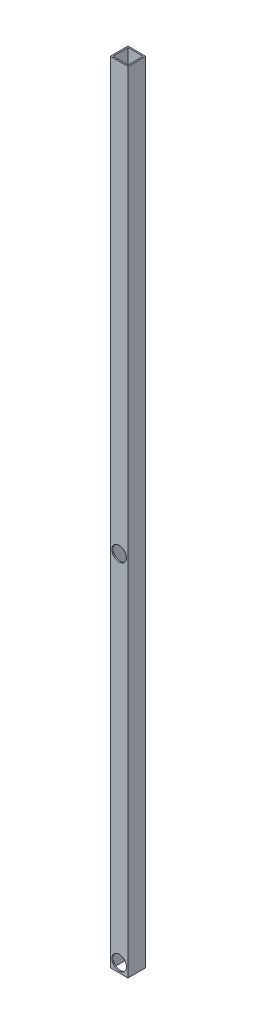
ISO-10303-21;
HEADER;
FILE_DESCRIPTION(('STEP AP214'),'2;1');
FILE_NAME('part.step','',(''),(''),'','','');
FILE_SCHEMA(('AUTOMOTIVE_DESIGN { 1 0 10303 214 1 1 1 1 }'));
ENDSEC;
DATA;
#1=APPLICATION_CONTEXT('core data for automotive mechanical design processes');
#2=APPLICATION_PROTOCOL_DEFINITION('international standard','automotive_design',2000,#1);
#3=PRODUCT_CONTEXT('',#1,'mechanical');
#4=PRODUCT('Part','Part','',(#3));
#5=PRODUCT_RELATED_PRODUCT_CATEGORY('part','',(#4));
#6=PRODUCT_DEFINITION_FORMATION('','',#4);
#7=PRODUCT_DEFINITION_CONTEXT('part definition',#1,'design');
#8=PRODUCT_DEFINITION('design','',#6,#7);
#9=PRODUCT_DEFINITION_SHAPE('','',#8);
#10=(LENGTH_UNIT() NAMED_UNIT(*) SI_UNIT(.MILLI.,.METRE.));
#11=(NAMED_UNIT(*) PLANE_ANGLE_UNIT() SI_UNIT($,.RADIAN.));
#12=(NAMED_UNIT(*) SI_UNIT($,.STERADIAN.) SOLID_ANGLE_UNIT());
#13=UNCERTAINTY_MEASURE_WITH_UNIT(LENGTH_MEASURE(1.E-05),#10,'distance_accuracy_value','');
#14=(GEOMETRIC_REPRESENTATION_CONTEXT(3) GLOBAL_UNCERTAINTY_ASSIGNED_CONTEXT((#13)) GLOBAL_UNIT_ASSIGNED_CONTEXT((#10,
#11,#12)) REPRESENTATION_CONTEXT('',''));
#15=CARTESIAN_POINT('',(0.,0.,0.));
#16=DIRECTION('',(0.,0.,1.));
#17=DIRECTION('',(1.,0.,0.));
#18=AXIS2_PLACEMENT_3D('',#15,#16,#17);
#19=CARTESIAN_POINT('',(0.,1981.2,0.));
#20=DIRECTION('',(0.,-1.,0.));
#21=DIRECTION('',(0.,0.,-1.));
#22=AXIS2_PLACEMENT_3D('',#19,#20,#21);
#23=PLANE('',#22);
#24=DIRECTION('',(0.,0.,1.));
#25=VECTOR('',#24,1.);
#26=CARTESIAN_POINT('',(0.,1981.2,0.));
#27=LINE('',#26,#25);
#28=CARTESIAN_POINT('',(0.,1981.2,-44.45));
#29=VERTEX_POINT('',#28);
#30=CARTESIAN_POINT('',(0.,1981.2,0.));
#31=VERTEX_POINT('',#30);
#32=EDGE_CURVE('E136',#29,#31,#27,.T.);
#33=ORIENTED_EDGE('',*,*,#32,.T.);
#34=DIRECTION('',(1.,0.,0.));
#35=VECTOR('',#34,1.);
#36=CARTESIAN_POINT('',(0.,1981.2,0.));
#37=LINE('',#36,#35);
#38=CARTESIAN_POINT('',(44.45,1981.2,0.));
#39=VERTEX_POINT('',#38);
#40=EDGE_CURVE('E139',#31,#39,#37,.T.);
#41=ORIENTED_EDGE('',*,*,#40,.T.);
#42=DIRECTION('',(0.,0.,-1.));
#43=VECTOR('',#42,1.);
#44=CARTESIAN_POINT('',(44.45,1981.2,0.));
#45=LINE('',#44,#43);
#46=CARTESIAN_POINT('',(44.45,1981.2,-44.45));
#47=VERTEX_POINT('',#46);
#48=EDGE_CURVE('E142',#39,#47,#45,.T.);
#49=ORIENTED_EDGE('',*,*,#48,.T.);
#50=DIRECTION('',(-1.,0.,0.));
#51=VECTOR('',#50,1.);
#52=CARTESIAN_POINT('',(0.,1981.2,-44.45));
#53=LINE('',#52,#51);
#54=EDGE_CURVE('E144',#47,#29,#53,.T.);
#55=ORIENTED_EDGE('',*,*,#54,.T.);
#56=EDGE_LOOP('',(#33,#41,#49,#55));
#57=FACE_BOUND('',#56,.T.);
#58=DIRECTION('',(1.,0.,0.));
#59=VECTOR('',#58,1.);
#60=CARTESIAN_POINT('',(3.175,1981.2,-3.175));
#61=LINE('',#60,#59);
#62=CARTESIAN_POINT('',(3.175,1981.2,-3.175));
#63=VERTEX_POINT('',#62);
#64=CARTESIAN_POINT('',(41.275,1981.2,-3.175));
#65=VERTEX_POINT('',#64);
#66=EDGE_CURVE('E98',#63,#65,#61,.T.);
#67=ORIENTED_EDGE('',*,*,#66,.F.);
#68=DIRECTION('',(0.,0.,1.));
#69=VECTOR('',#68,1.);
#70=CARTESIAN_POINT('',(3.175,1981.2,-3.175));
#71=LINE('',#70,#69);
#72=CARTESIAN_POINT('',(3.175,1981.2,-41.275));
#73=VERTEX_POINT('',#72);
#74=EDGE_CURVE('E120',#73,#63,#71,.T.);
#75=ORIENTED_EDGE('',*,*,#74,.F.);
#76=DIRECTION('',(-1.,0.,0.));
#77=VECTOR('',#76,1.);
#78=CARTESIAN_POINT('',(3.175,1981.2,-41.275));
#79=LINE('',#78,#77);
#80=CARTESIAN_POINT('',(41.275,1981.2,-41.275));
#81=VERTEX_POINT('',#80);
#82=EDGE_CURVE('E118',#81,#73,#79,.T.);
#83=ORIENTED_EDGE('',*,*,#82,.F.);
#84=DIRECTION('',(0.,0.,-1.));
#85=VECTOR('',#84,1.);
#86=CARTESIAN_POINT('',(41.275,1981.2,-3.175));
#87=LINE('',#86,#85);
#88=EDGE_CURVE('E106',#65,#81,#87,.T.);
#89=ORIENTED_EDGE('',*,*,#88,.F.);
#90=EDGE_LOOP('',(#67,#75,#83,#89));
#91=FACE_BOUND('',#90,.T.);
#92=ADVANCED_FACE('F33',(#57,#91),#23,.F.);
#93=CARTESIAN_POINT('',(0.,0.,0.));
#94=DIRECTION('',(0.,-1.,0.));
#95=DIRECTION('',(0.,0.,-1.));
#96=AXIS2_PLACEMENT_3D('',#93,#94,#95);
#97=PLANE('',#96);
#98=DIRECTION('',(0.,0.,1.));
#99=VECTOR('',#98,1.);
#100=CARTESIAN_POINT('',(0.,0.,0.));
#101=LINE('',#100,#99);
#102=CARTESIAN_POINT('',(0.,0.,-44.45));
#103=VERTEX_POINT('',#102);
#104=CARTESIAN_POINT('',(0.,0.,0.));
#105=VERTEX_POINT('',#104);
#106=EDGE_CURVE('E114',#103,#105,#101,.T.);
#107=ORIENTED_EDGE('',*,*,#106,.F.);
#108=DIRECTION('',(-1.,0.,0.));
#109=VECTOR('',#108,1.);
#110=CARTESIAN_POINT('',(0.,0.,-44.45));
#111=LINE('',#110,#109);
#112=CARTESIAN_POINT('',(44.45,0.,-44.45));
#113=VERTEX_POINT('',#112);
#114=EDGE_CURVE('E140',#113,#103,#111,.T.);
#115=ORIENTED_EDGE('',*,*,#114,.F.);
#116=DIRECTION('',(0.,0.,-1.));
#117=VECTOR('',#116,1.);
#118=CARTESIAN_POINT('',(44.45,0.,0.));
#119=LINE('',#118,#117);
#120=CARTESIAN_POINT('',(44.45,0.,0.));
#121=VERTEX_POINT('',#120);
#122=EDGE_CURVE('E151',#121,#113,#119,.T.);
#123=ORIENTED_EDGE('',*,*,#122,.F.);
#124=DIRECTION('',(1.,0.,0.));
#125=VECTOR('',#124,1.);
#126=CARTESIAN_POINT('',(0.,0.,0.));
#127=LINE('',#126,#125);
#128=EDGE_CURVE('E149',#105,#121,#127,.T.);
#129=ORIENTED_EDGE('',*,*,#128,.F.);
#130=EDGE_LOOP('',(#107,#115,#123,#129));
#131=FACE_BOUND('',#130,.T.);
#132=DIRECTION('',(0.,0.,1.));
#133=VECTOR('',#132,1.);
#134=CARTESIAN_POINT('',(3.175,0.,-3.175));
#135=LINE('',#134,#133);
#136=CARTESIAN_POINT('',(3.175,0.,-41.275));
#137=VERTEX_POINT('',#136);
#138=CARTESIAN_POINT('',(3.175,0.,-3.175));
#139=VERTEX_POINT('',#138);
#140=EDGE_CURVE('E107',#137,#139,#135,.T.);
#141=ORIENTED_EDGE('',*,*,#140,.T.);
#142=DIRECTION('',(1.,0.,0.));
#143=VECTOR('',#142,1.);
#144=CARTESIAN_POINT('',(3.175,0.,-3.175));
#145=LINE('',#144,#143);
#146=CARTESIAN_POINT('',(41.275,0.,-3.175));
#147=VERTEX_POINT('',#146);
#148=EDGE_CURVE('E56',#139,#147,#145,.T.);
#149=ORIENTED_EDGE('',*,*,#148,.T.);
#150=DIRECTION('',(0.,0.,-1.));
#151=VECTOR('',#150,1.);
#152=CARTESIAN_POINT('',(41.275,0.,-3.175));
#153=LINE('',#152,#151);
#154=CARTESIAN_POINT('',(41.275,0.,-41.275));
#155=VERTEX_POINT('',#154);
#156=EDGE_CURVE('E113',#147,#155,#153,.T.);
#157=ORIENTED_EDGE('',*,*,#156,.T.);
#158=DIRECTION('',(-1.,0.,0.));
#159=VECTOR('',#158,1.);
#160=CARTESIAN_POINT('',(3.175,0.,-41.275));
#161=LINE('',#160,#159);
#162=EDGE_CURVE('E128',#155,#137,#161,.T.);
#163=ORIENTED_EDGE('',*,*,#162,.T.);
#164=EDGE_LOOP('',(#141,#149,#157,#163));
#165=FACE_BOUND('',#164,.T.);
#166=ADVANCED_FACE('F169',(#131,#165),#97,.T.);
#167=CARTESIAN_POINT('',(0.,1981.2,0.));
#168=DIRECTION('',(1.,0.,0.));
#169=DIRECTION('',(0.,0.,-1.));
#170=AXIS2_PLACEMENT_3D('',#167,#168,#169);
#171=PLANE('',#170);
#172=ORIENTED_EDGE('',*,*,#106,.T.);
#173=DIRECTION('',(0.,-1.,0.));
#174=VECTOR('',#173,1.);
#175=CARTESIAN_POINT('',(0.,1981.2,0.));
#176=LINE('',#175,#174);
#177=EDGE_CURVE('E11',#31,#105,#176,.T.);
#178=ORIENTED_EDGE('',*,*,#177,.F.);
#179=ORIENTED_EDGE('',*,*,#32,.F.);
#180=DIRECTION('',(0.,-1.,0.));
#181=VECTOR('',#180,1.);
#182=CARTESIAN_POINT('',(0.,1981.2,-44.45));
#183=LINE('',#182,#181);
#184=EDGE_CURVE('E146',#29,#103,#183,.T.);
#185=ORIENTED_EDGE('',*,*,#184,.T.);
#186=EDGE_LOOP('',(#172,#178,#179,#185));
#187=FACE_BOUND('',#186,.T.);
#188=ADVANCED_FACE('F35',(#187),#171,.F.);
#189=CARTESIAN_POINT('',(0.,1981.2,0.));
#190=DIRECTION('',(0.,0.,-1.));
#191=DIRECTION('',(-1.,0.,0.));
#192=AXIS2_PLACEMENT_3D('',#189,#190,#191);
#193=PLANE('',#192);
#194=CARTESIAN_POINT('',(22.225,22.225,0.));
#195=DIRECTION('',(0.,0.,1.));
#196=DIRECTION('',(1.,0.,0.));
#197=AXIS2_PLACEMENT_3D('',#194,#195,#196);
#198=CIRCLE('',#197,18.25625);
#199=CARTESIAN_POINT('',(40.48125,22.225,0.));
#200=VERTEX_POINT('',#199);
#201=EDGE_CURVE('E126',#200,#200,#198,.T.);
#202=ORIENTED_EDGE('',*,*,#201,.F.);
#203=EDGE_LOOP('',(#202));
#204=FACE_BOUND('',#203,.T.);
#205=CARTESIAN_POINT('',(22.225,911.225,0.));
#206=DIRECTION('',(0.,0.,1.));
#207=DIRECTION('',(1.,0.,0.));
#208=AXIS2_PLACEMENT_3D('',#205,#206,#207);
#209=CIRCLE('',#208,18.25625);
#210=CARTESIAN_POINT('',(40.48125,911.225,0.));
#211=VERTEX_POINT('',#210);
#212=EDGE_CURVE('E224',#211,#211,#209,.T.);
#213=ORIENTED_EDGE('',*,*,#212,.F.);
#214=EDGE_LOOP('',(#213));
#215=FACE_BOUND('',#214,.T.);
#216=ORIENTED_EDGE('',*,*,#128,.T.);
#217=DIRECTION('',(0.,-1.,0.));
#218=VECTOR('',#217,1.);
#219=CARTESIAN_POINT('',(44.45,1981.2,0.));
#220=LINE('',#219,#218);
#221=EDGE_CURVE('E41',#39,#121,#220,.T.);
#222=ORIENTED_EDGE('',*,*,#221,.F.);
#223=ORIENTED_EDGE('',*,*,#40,.F.);
#224=ORIENTED_EDGE('',*,*,#177,.T.);
#225=EDGE_LOOP('',(#216,#222,#223,#224));
#226=FACE_BOUND('',#225,.T.);
#227=ADVANCED_FACE('F179',(#204,#215,#226),#193,.F.);
#228=CARTESIAN_POINT('',(44.45,1981.2,0.));
#229=DIRECTION('',(-1.,0.,0.));
#230=DIRECTION('',(0.,0.,1.));
#231=AXIS2_PLACEMENT_3D('',#228,#229,#230);
#232=PLANE('',#231);
#233=ORIENTED_EDGE('',*,*,#122,.T.);
#234=DIRECTION('',(0.,-1.,0.));
#235=VECTOR('',#234,1.);
#236=CARTESIAN_POINT('',(44.45,1981.2,-44.45));
#237=LINE('',#236,#235);
#238=EDGE_CURVE('E156',#47,#113,#237,.T.);
#239=ORIENTED_EDGE('',*,*,#238,.F.);
#240=ORIENTED_EDGE('',*,*,#48,.F.);
#241=ORIENTED_EDGE('',*,*,#221,.T.);
#242=EDGE_LOOP('',(#233,#239,#240,#241));
#243=FACE_BOUND('',#242,.T.);
#244=ADVANCED_FACE('F163',(#243),#232,.F.);
#245=CARTESIAN_POINT('',(0.,1981.2,-44.45));
#246=DIRECTION('',(0.,0.,1.));
#247=DIRECTION('',(1.,0.,0.));
#248=AXIS2_PLACEMENT_3D('',#245,#246,#247);
#249=PLANE('',#248);
#250=CARTESIAN_POINT('',(22.225,911.225,-44.45));
#251=DIRECTION('',(0.,0.,-1.));
#252=DIRECTION('',(-1.,0.,0.));
#253=AXIS2_PLACEMENT_3D('',#250,#251,#252);
#254=CIRCLE('',#253,12.7);
#255=CARTESIAN_POINT('',(9.525,911.225,-44.45));
#256=VERTEX_POINT('',#255);
#257=EDGE_CURVE('E207',#256,#256,#254,.T.);
#258=ORIENTED_EDGE('',*,*,#257,.F.);
#259=EDGE_LOOP('',(#258));
#260=FACE_BOUND('',#259,.T.);
#261=CARTESIAN_POINT('',(22.225,22.225,-44.45));
#262=DIRECTION('',(0.,0.,-1.));
#263=DIRECTION('',(-1.,0.,0.));
#264=AXIS2_PLACEMENT_3D('',#261,#262,#263);
#265=CIRCLE('',#264,12.7);
#266=CARTESIAN_POINT('',(9.525,22.225,-44.45));
#267=VERTEX_POINT('',#266);
#268=EDGE_CURVE('E210',#267,#267,#265,.T.);
#269=ORIENTED_EDGE('',*,*,#268,.F.);
#270=EDGE_LOOP('',(#269));
#271=FACE_BOUND('',#270,.T.);
#272=ORIENTED_EDGE('',*,*,#114,.T.);
#273=ORIENTED_EDGE('',*,*,#184,.F.);
#274=ORIENTED_EDGE('',*,*,#54,.F.);
#275=ORIENTED_EDGE('',*,*,#238,.T.);
#276=EDGE_LOOP('',(#272,#273,#274,#275));
#277=FACE_BOUND('',#276,.T.);
#278=ADVANCED_FACE('F173',(#260,#271,#277),#249,.F.);
#279=CARTESIAN_POINT('',(3.175,1981.2,-3.175));
#280=DIRECTION('',(0.,0.,-1.));
#281=DIRECTION('',(-1.,0.,0.));
#282=AXIS2_PLACEMENT_3D('',#279,#280,#281);
#283=PLANE('',#282);
#284=CARTESIAN_POINT('',(22.225,22.225,-3.175));
#285=DIRECTION('',(0.,0.,-1.));
#286=DIRECTION('',(-1.,0.,0.));
#287=AXIS2_PLACEMENT_3D('',#284,#285,#286);
#288=CIRCLE('',#287,18.25625);
#289=CARTESIAN_POINT('',(3.96875,22.225,-3.175));
#290=VERTEX_POINT('',#289);
#291=EDGE_CURVE('E221',#290,#290,#288,.F.);
#292=ORIENTED_EDGE('',*,*,#291,.T.);
#293=EDGE_LOOP('',(#292));
#294=FACE_BOUND('',#293,.T.);
#295=CARTESIAN_POINT('',(22.225,911.225,-3.175));
#296=DIRECTION('',(0.,0.,-1.));
#297=DIRECTION('',(-1.,0.,0.));
#298=AXIS2_PLACEMENT_3D('',#295,#296,#297);
#299=CIRCLE('',#298,18.25625);
#300=CARTESIAN_POINT('',(3.96875,911.225,-3.175));
#301=VERTEX_POINT('',#300);
#302=EDGE_CURVE('E227',#301,#301,#299,.F.);
#303=ORIENTED_EDGE('',*,*,#302,.T.);
#304=EDGE_LOOP('',(#303));
#305=FACE_BOUND('',#304,.T.);
#306=ORIENTED_EDGE('',*,*,#148,.F.);
#307=DIRECTION('',(0.,-1.,0.));
#308=VECTOR('',#307,1.);
#309=CARTESIAN_POINT('',(3.175,1981.2,-3.175));
#310=LINE('',#309,#308);
#311=EDGE_CURVE('E102',#63,#139,#310,.T.);
#312=ORIENTED_EDGE('',*,*,#311,.F.);
#313=ORIENTED_EDGE('',*,*,#66,.T.);
#314=DIRECTION('',(0.,-1.,0.));
#315=VECTOR('',#314,1.);
#316=CARTESIAN_POINT('',(41.275,1981.2,-3.175));
#317=LINE('',#316,#315);
#318=EDGE_CURVE('E101',#65,#147,#317,.T.);
#319=ORIENTED_EDGE('',*,*,#318,.T.);
#320=EDGE_LOOP('',(#306,#312,#313,#319));
#321=FACE_BOUND('',#320,.T.);
#322=ADVANCED_FACE('F100',(#294,#305,#321),#283,.T.);
#323=CARTESIAN_POINT('',(41.275,1981.2,-3.175));
#324=DIRECTION('',(-1.,0.,0.));
#325=DIRECTION('',(0.,0.,1.));
#326=AXIS2_PLACEMENT_3D('',#323,#324,#325);
#327=PLANE('',#326);
#328=ORIENTED_EDGE('',*,*,#156,.F.);
#329=ORIENTED_EDGE('',*,*,#318,.F.);
#330=ORIENTED_EDGE('',*,*,#88,.T.);
#331=DIRECTION('',(0.,-1.,0.));
#332=VECTOR('',#331,1.);
#333=CARTESIAN_POINT('',(41.275,1981.2,-41.275));
#334=LINE('',#333,#332);
#335=EDGE_CURVE('E115',#81,#155,#334,.T.);
#336=ORIENTED_EDGE('',*,*,#335,.T.);
#337=EDGE_LOOP('',(#328,#329,#330,#336));
#338=FACE_BOUND('',#337,.T.);
#339=ADVANCED_FACE('F110',(#338),#327,.T.);
#340=CARTESIAN_POINT('',(3.175,1981.2,-41.275));
#341=DIRECTION('',(0.,0.,1.));
#342=DIRECTION('',(1.,0.,0.));
#343=AXIS2_PLACEMENT_3D('',#340,#341,#342);
#344=PLANE('',#343);
#345=CARTESIAN_POINT('',(22.225,911.225,-41.275));
#346=DIRECTION('',(0.,0.,1.));
#347=DIRECTION('',(1.,0.,0.));
#348=AXIS2_PLACEMENT_3D('',#345,#346,#347);
#349=CIRCLE('',#348,12.7);
#350=CARTESIAN_POINT('',(34.925,911.225,-41.275));
#351=VERTEX_POINT('',#350);
#352=EDGE_CURVE('E212',#351,#351,#349,.F.);
#353=ORIENTED_EDGE('',*,*,#352,.T.);
#354=EDGE_LOOP('',(#353));
#355=FACE_BOUND('',#354,.T.);
#356=CARTESIAN_POINT('',(22.225,22.225,-41.275));
#357=DIRECTION('',(0.,0.,1.));
#358=DIRECTION('',(1.,0.,0.));
#359=AXIS2_PLACEMENT_3D('',#356,#357,#358);
#360=CIRCLE('',#359,12.7);
#361=CARTESIAN_POINT('',(34.925,22.225,-41.275));
#362=VERTEX_POINT('',#361);
#363=EDGE_CURVE('E213',#362,#362,#360,.F.);
#364=ORIENTED_EDGE('',*,*,#363,.T.);
#365=EDGE_LOOP('',(#364));
#366=FACE_BOUND('',#365,.T.);
#367=ORIENTED_EDGE('',*,*,#162,.F.);
#368=ORIENTED_EDGE('',*,*,#335,.F.);
#369=ORIENTED_EDGE('',*,*,#82,.T.);
#370=DIRECTION('',(0.,-1.,0.));
#371=VECTOR('',#370,1.);
#372=CARTESIAN_POINT('',(3.175,1981.2,-41.275));
#373=LINE('',#372,#371);
#374=EDGE_CURVE('E48',#73,#137,#373,.T.);
#375=ORIENTED_EDGE('',*,*,#374,.T.);
#376=EDGE_LOOP('',(#367,#368,#369,#375));
#377=FACE_BOUND('',#376,.T.);
#378=ADVANCED_FACE('F245',(#355,#366,#377),#344,.T.);
#379=CARTESIAN_POINT('',(3.175,1981.2,-3.175));
#380=DIRECTION('',(1.,0.,0.));
#381=DIRECTION('',(0.,0.,-1.));
#382=AXIS2_PLACEMENT_3D('',#379,#380,#381);
#383=PLANE('',#382);
#384=ORIENTED_EDGE('',*,*,#140,.F.);
#385=ORIENTED_EDGE('',*,*,#374,.F.);
#386=ORIENTED_EDGE('',*,*,#74,.T.);
#387=ORIENTED_EDGE('',*,*,#311,.T.);
#388=EDGE_LOOP('',(#384,#385,#386,#387));
#389=FACE_BOUND('',#388,.T.);
#390=ADVANCED_FACE('F235',(#389),#383,.T.);
#391=CARTESIAN_POINT('',(22.225,911.225,-44.451));
#392=DIRECTION('',(0.,0.,1.));
#393=DIRECTION('',(1.,0.,0.));
#394=AXIS2_PLACEMENT_3D('',#391,#392,#393);
#395=CYLINDRICAL_SURFACE('',#394,18.25625);
#396=ORIENTED_EDGE('',*,*,#302,.F.);
#397=EDGE_LOOP('',(#396));
#398=FACE_BOUND('',#397,.T.);
#399=ORIENTED_EDGE('',*,*,#212,.T.);
#400=EDGE_LOOP('',(#399));
#401=FACE_BOUND('',#400,.T.);
#402=ADVANCED_FACE('F232',(#398,#401),#395,.F.);
#403=CARTESIAN_POINT('',(22.225,22.225,-44.451));
#404=DIRECTION('',(0.,0.,1.));
#405=DIRECTION('',(1.,0.,0.));
#406=AXIS2_PLACEMENT_3D('',#403,#404,#405);
#407=CYLINDRICAL_SURFACE('',#406,18.25625);
#408=ORIENTED_EDGE('',*,*,#291,.F.);
#409=EDGE_LOOP('',(#408));
#410=FACE_BOUND('',#409,.T.);
#411=ORIENTED_EDGE('',*,*,#201,.T.);
#412=EDGE_LOOP('',(#411));
#413=FACE_BOUND('',#412,.T.);
#414=ADVANCED_FACE('F234',(#410,#413),#407,.F.);
#415=CARTESIAN_POINT('',(22.225,22.225,0.001000000000001));
#416=DIRECTION('',(0.,0.,-1.));
#417=DIRECTION('',(-1.,0.,0.));
#418=AXIS2_PLACEMENT_3D('',#415,#416,#417);
#419=CYLINDRICAL_SURFACE('',#418,12.7);
#420=ORIENTED_EDGE('',*,*,#363,.F.);
#421=EDGE_LOOP('',(#420));
#422=FACE_BOUND('',#421,.T.);
#423=ORIENTED_EDGE('',*,*,#268,.T.);
#424=EDGE_LOOP('',(#423));
#425=FACE_BOUND('',#424,.T.);
#426=ADVANCED_FACE('F242',(#422,#425),#419,.F.);
#427=CARTESIAN_POINT('',(22.225,911.225,0.001000000000001));
#428=DIRECTION('',(0.,0.,-1.));
#429=DIRECTION('',(-1.,0.,0.));
#430=AXIS2_PLACEMENT_3D('',#427,#428,#429);
#431=CYLINDRICAL_SURFACE('',#430,12.7);
#432=ORIENTED_EDGE('',*,*,#352,.F.);
#433=EDGE_LOOP('',(#432));
#434=FACE_BOUND('',#433,.T.);
#435=ORIENTED_EDGE('',*,*,#257,.T.);
#436=EDGE_LOOP('',(#435));
#437=FACE_BOUND('',#436,.T.);
#438=ADVANCED_FACE('F318',(#434,#437),#431,.F.);
#439=CLOSED_SHELL('',(#92,#166,#188,#227,#244,#278,#322,#339,#378,#390,#402,#414,#426,#438));
#440=MANIFOLD_SOLID_BREP('B2',#439);
#441=ADVANCED_BREP_SHAPE_REPRESENTATION('',(#18,#440),#14);
#442=SHAPE_DEFINITION_REPRESENTATION(#9,#441);
ENDSEC;
END-ISO-10303-21;
